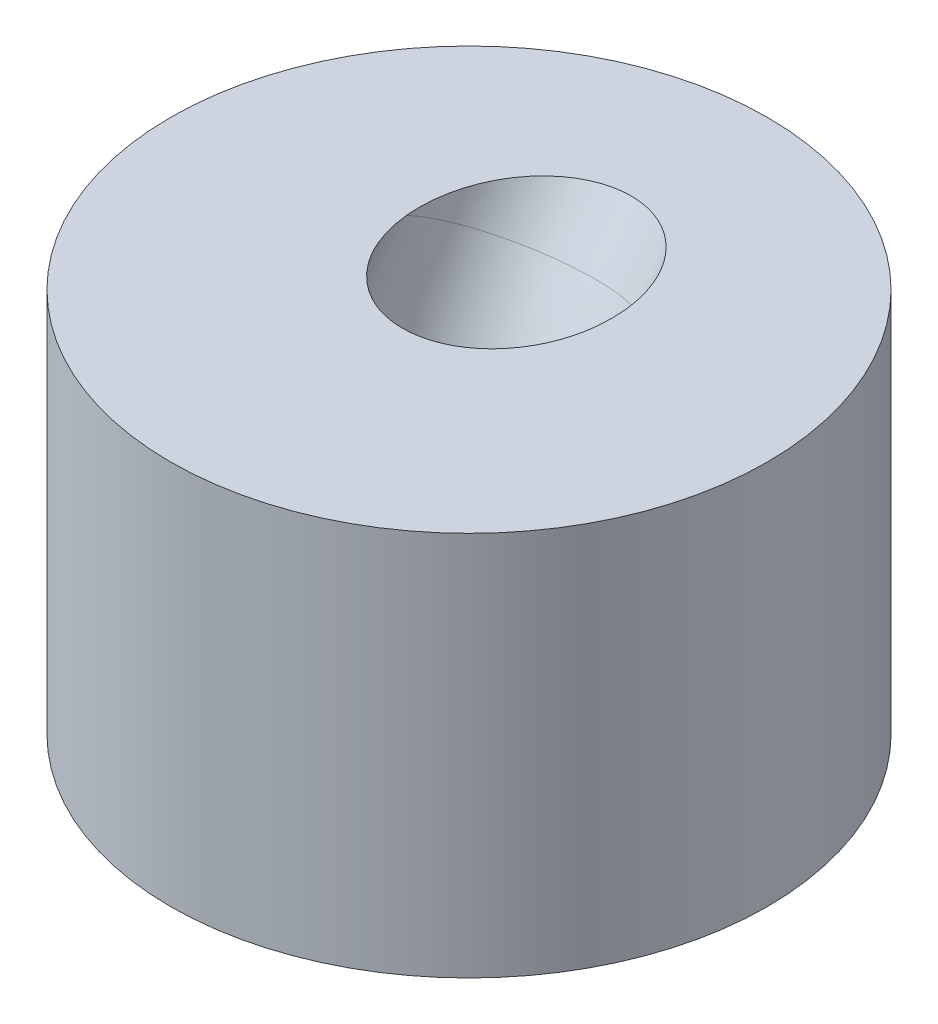
ISO-10303-21;
HEADER;
FILE_DESCRIPTION(('STEP AP214'),'2;1');
FILE_NAME('part.step','',(''),(''),'','','');
FILE_SCHEMA(('AUTOMOTIVE_DESIGN { 1 0 10303 214 1 1 1 1 }'));
ENDSEC;
DATA;
#1=APPLICATION_CONTEXT('core data for automotive mechanical design processes');
#2=APPLICATION_PROTOCOL_DEFINITION('international standard','automotive_design',2000,#1);
#3=PRODUCT_CONTEXT('',#1,'mechanical');
#4=PRODUCT('Part','Part','',(#3));
#5=PRODUCT_RELATED_PRODUCT_CATEGORY('part','',(#4));
#6=PRODUCT_DEFINITION_FORMATION('','',#4);
#7=PRODUCT_DEFINITION_CONTEXT('part definition',#1,'design');
#8=PRODUCT_DEFINITION('design','',#6,#7);
#9=PRODUCT_DEFINITION_SHAPE('','',#8);
#10=(LENGTH_UNIT() NAMED_UNIT(*) SI_UNIT(.MILLI.,.METRE.));
#11=(NAMED_UNIT(*) PLANE_ANGLE_UNIT() SI_UNIT($,.RADIAN.));
#12=(NAMED_UNIT(*) SI_UNIT($,.STERADIAN.) SOLID_ANGLE_UNIT());
#13=UNCERTAINTY_MEASURE_WITH_UNIT(LENGTH_MEASURE(1.E-05),#10,'distance_accuracy_value','');
#14=(GEOMETRIC_REPRESENTATION_CONTEXT(3) GLOBAL_UNCERTAINTY_ASSIGNED_CONTEXT((#13)) GLOBAL_UNIT_ASSIGNED_CONTEXT((#10,
#11,#12)) REPRESENTATION_CONTEXT('',''));
#15=CARTESIAN_POINT('',(0.,0.,0.));
#16=DIRECTION('',(0.,0.,1.));
#17=DIRECTION('',(1.,0.,0.));
#18=AXIS2_PLACEMENT_3D('',#15,#16,#17);
#19=CARTESIAN_POINT('',(0.,1.,0.));
#20=DIRECTION('',(0.,1.,0.));
#21=DIRECTION('',(0.,0.,1.));
#22=AXIS2_PLACEMENT_3D('',#19,#20,#21);
#23=PLANE('',#22);
#24=CARTESIAN_POINT('',(0.,1.,0.));
#25=DIRECTION('',(0.,1.,0.));
#26=DIRECTION('',(0.,0.,1.));
#27=AXIS2_PLACEMENT_3D('',#24,#25,#26);
#28=CIRCLE('',#27,0.775);
#29=CARTESIAN_POINT('',(0.,1.,0.775));
#30=VERTEX_POINT('',#29);
#31=EDGE_CURVE('E48',#30,#30,#28,.T.);
#32=ORIENTED_EDGE('',*,*,#31,.T.);
#33=EDGE_LOOP('',(#32));
#34=FACE_BOUND('',#33,.T.);
#35=CARTESIAN_POINT('',(-0.248215276221464,1.,-0.0855223372953399));
#36=CARTESIAN_POINT('',(-0.246124175049381,1.,-0.0644706667991385));
#37=CARTESIAN_POINT('',(-0.24210697818723,1.,-0.0435278417130061));
#38=CARTESIAN_POINT('',(-0.230138842864011,1.,-0.00270959480504173));
#39=CARTESIAN_POINT('',(-0.222170859785815,1.,0.0171607846832364));
#40=CARTESIAN_POINT('',(-0.204990927327437,1.,0.0495865046512104));
#41=CARTESIAN_POINT('',(-0.196731129213487,1.,0.0626459520367304));
#42=CARTESIAN_POINT('',(-0.178175206384651,1.,0.0872180136886346));
#43=CARTESIAN_POINT('',(-0.167881807736467,1.,0.0987326644500661));
#44=CARTESIAN_POINT('',(-0.145321340496363,1.,0.119826710274702));
#45=CARTESIAN_POINT('',(-0.133040945378598,1.,0.129391976896492));
#46=CARTESIAN_POINT('',(-0.10685532063701,1.,0.145979415976943));
#47=CARTESIAN_POINT('',(-0.0929506049289702,1.,0.153002389919976));
#48=CARTESIAN_POINT('',(-0.0658008355966637,1.,0.163374792792679));
#49=CARTESIAN_POINT('',(-0.0526884157307585,1.,0.167072193668631));
#50=CARTESIAN_POINT('',(-0.0259895384577077,0.999999999999999,0.171979883642039));
#51=CARTESIAN_POINT('',(-0.0124027561369748,0.999999999999998,0.173188432616338));
#52=CARTESIAN_POINT('',(0.0135400435151004,1.,0.17304899610204));
#53=CARTESIAN_POINT('',(0.0258977982896824,1.00000000000001,0.171919322963314));
#54=CARTESIAN_POINT('',(0.050259306033422,0.999999999999993,0.16758858116793));
#55=CARTESIAN_POINT('',(0.0622626030327193,0.999999999999973,0.164384956441295));
#56=CARTESIAN_POINT('',(0.0855144795981385,1.00000000000003,0.156071154860137));
#57=CARTESIAN_POINT('',(0.0967667230127277,1.0000000000001,0.150971175872131));
#58=CARTESIAN_POINT('',(0.118343128334914,0.999999999999901,0.139073446192681));
#59=CARTESIAN_POINT('',(0.128665850129091,0.999999999999629,0.132273120671145));
#60=CARTESIAN_POINT('',(0.159264764842178,1.00000000000079,0.108645536902197));
#61=CARTESIAN_POINT('',(0.177560500223876,1.00000000000451,0.089189901603906));
#62=CARTESIAN_POINT('',(0.209892360590161,0.999999999994933,0.0433999857771069));
#63=CARTESIAN_POINT('',(0.223126429482738,0.999999999979483,0.0165136595637087));
#64=CARTESIAN_POINT('',(0.236505530129137,0.999999999988811,-0.0235475202659346));
#65=CARTESIAN_POINT('',(0.23980852506951,0.999999999995644,-0.0357769723893151));
#66=CARTESIAN_POINT('',(0.245030006059433,1.00000000000434,-0.0604860161791928));
#67=CARTESIAN_POINT('',(0.246953142568255,1.00000000000622,-0.0729646205694481));
#68=CARTESIAN_POINT('',(0.248215276221415,0.999999999999194,-0.0855223372945839));
#69=B_SPLINE_CURVE_WITH_KNOTS('',3,(#35,#36,#37,#38,#39,#40,#41,#42,#43,#44,#45,#46,#47,#48,#49,
#50,#51,#52,#53,#54,#55,#56,#57,#58,#59,#60,#61,#62,#63,#64,#65,#66,#67,#68),.UNSPECIFIED.,.F.,
.F.,(4,2,2,2,2,2,2,2,2,2,2,2,2,2,2,2,4),(0.,0.0635184526410341,0.127313354841293,
0.173479984958425,0.219585142994132,0.266013420517455,0.312427048266889,0.353074863650539,
0.393751089010639,0.430800985192004,0.467896631180527,0.504795610020645,0.541750806916499,
0.620594319427059,0.709147530728517,0.747092037627843,0.784908053813709),.UNSPECIFIED.);
#70=CARTESIAN_POINT('',(-0.248215276221464,1.,-0.0855223372953399));
#71=VERTEX_POINT('',#70);
#72=CARTESIAN_POINT('',(0.248215276221464,1.,-0.0855223372953399));
#73=VERTEX_POINT('',#72);
#74=EDGE_CURVE('E57',#71,#73,#69,.T.);
#75=ORIENTED_EDGE('',*,*,#74,.F.);
#76=CARTESIAN_POINT('',(-0.248215276221464,1.,-0.0855223372953399));
#77=CARTESIAN_POINT('',(-0.25028665344192,1.,-0.106268796895166));
#78=CARTESIAN_POINT('',(-0.250554870402239,1.,-0.127202110870171));
#79=CARTESIAN_POINT('',(-0.247557000832603,0.999999999999999,-0.16753253543577));
#80=CARTESIAN_POINT('',(-0.244504273879469,0.999999999999999,-0.186945817856314));
#81=CARTESIAN_POINT('',(-0.235402870254637,1.00000000000001,-0.224080560944886));
#82=CARTESIAN_POINT('',(-0.229504751758066,1.00000000000002,-0.241838515390821));
#83=CARTESIAN_POINT('',(-0.215297622720401,1.00000000000009,-0.274859683669143));
#84=CARTESIAN_POINT('',(-0.207193760351343,1.00000000000015,-0.290210441057354));
#85=CARTESIAN_POINT('',(-0.189254449640098,1.00000000000025,-0.318074729189423));
#86=CARTESIAN_POINT('',(-0.179622729829535,1.0000000000003,-0.330718361422361));
#87=CARTESIAN_POINT('',(-0.159233846170141,1.00000000000033,-0.353157941768768));
#88=CARTESIAN_POINT('',(-0.148644525607957,1.00000000000032,-0.363105234541551));
#89=CARTESIAN_POINT('',(-0.126802123487262,1.00000000000025,-0.38032762052075));
#90=CARTESIAN_POINT('',(-0.115667298648004,1.00000000000021,-0.387751609865257));
#91=CARTESIAN_POINT('',(-0.0930464816948879,1.00000000000012,-0.400167071172064));
#92=CARTESIAN_POINT('',(-0.0816306849954921,1.00000000000009,-0.40528555493495));
#93=CARTESIAN_POINT('',(-0.0586385820530041,1.00000000000004,-0.413316171500651));
#94=CARTESIAN_POINT('',(-0.0470944934858634,1.00000000000002,-0.416319931464706));
#95=CARTESIAN_POINT('',(-0.0239502602514634,1.00000000000001,-0.420290485545516));
#96=CARTESIAN_POINT('',(-0.0123584295587039,1.,-0.42130541653493));
#97=CARTESIAN_POINT('',(0.0108270354387798,1.,-0.421390594164474));
#98=CARTESIAN_POINT('',(0.0224206667030261,1.,-0.420461696707975));
#99=CARTESIAN_POINT('',(0.0454385790931325,1.,-0.41668488324374));
#100=CARTESIAN_POINT('',(0.0568589542307153,0.999999999999999,-0.41381321721285));
#101=CARTESIAN_POINT('',(0.0790986976212688,1.,-0.406275347574439));
#102=CARTESIAN_POINT('',(0.0899171144777534,1.,-0.40160639066646));
#103=CARTESIAN_POINT('',(0.121999597683588,1.00000000000001,-0.384725616676555));
#104=CARTESIAN_POINT('',(0.141884405543346,0.999999999999998,-0.36982166281364));
#105=CARTESIAN_POINT('',(0.179000598662868,1.00000000000002,-0.333011978850793));
#106=CARTESIAN_POINT('',(0.195565607843253,1.00000000000006,-0.31045381915996));
#107=CARTESIAN_POINT('',(0.21654497553342,1.00000000000004,-0.272189472804572));
#108=CARTESIAN_POINT('',(0.223137911489291,1.00000000000001,-0.257602544000118));
#109=CARTESIAN_POINT('',(0.234173862313291,0.99999999999999,-0.227633152818644));
#110=CARTESIAN_POINT('',(0.238617587640675,0.999999999999997,-0.21225095519541));
#111=CARTESIAN_POINT('',(0.245365532066509,1.,-0.181036954373498));
#112=CARTESIAN_POINT('',(0.247670167297284,1.,-0.165205239240495));
#113=CARTESIAN_POINT('',(0.250563935535714,0.999999999999998,-0.128076250792981));
#114=CARTESIAN_POINT('',(0.25032810727948,0.999999999999995,-0.106711608143289));
#115=CARTESIAN_POINT('',(0.248215276221464,1.,-0.0855223372953402));
#116=B_SPLINE_CURVE_WITH_KNOTS('',3,(#76,#77,#78,#79,#80,#81,#82,#83,#84,#85,#86,#87,#88,#89,
#90,#91,#92,#93,#94,#95,#96,#97,#98,#99,#100,#101,#102,#103,#104,#105,#106,#107,#108,#109,#110,
#111,#112,#113,#114,#115),.UNSPECIFIED.,.F.,.F.,(4,2,2,2,2,2,2,2,2,2,2,2,2,2,2,2,2,2,2,4),(0.,
0.0624806338945161,0.121171983539215,0.177051161265889,0.228890111769629,0.276356264416739,
0.319743418434738,0.359707972136692,0.397067618916713,0.432687898133009,0.467434835550426,
0.502166476472362,0.537330567059254,0.572548741876997,0.645916590712587,0.728684477337392,
0.776568210002096,0.82443610302227,0.872294682009731,0.936062774952509),.UNSPECIFIED.);
#117=EDGE_CURVE('E11',#71,#73,#116,.T.);
#118=ORIENTED_EDGE('',*,*,#117,.T.);
#119=EDGE_LOOP('',(#75,#118));
#120=FACE_BOUND('',#119,.T.);
#121=ADVANCED_FACE('F35',(#34,#120),#23,.T.);
#122=CARTESIAN_POINT('',(0.,1.,0.));
#123=DIRECTION('',(0.,-1.,0.));
#124=DIRECTION('',(0.,0.,-1.));
#125=AXIS2_PLACEMENT_3D('',#122,#123,#124);
#126=CYLINDRICAL_SURFACE('',#125,0.775);
#127=ORIENTED_EDGE('',*,*,#31,.F.);
#128=EDGE_LOOP('',(#127));
#129=FACE_BOUND('',#128,.T.);
#130=CARTESIAN_POINT('',(0.,0.,0.));
#131=DIRECTION('',(0.,1.,0.));
#132=DIRECTION('',(0.,0.,1.));
#133=AXIS2_PLACEMENT_3D('',#130,#131,#132);
#134=CIRCLE('',#133,0.775);
#135=CARTESIAN_POINT('',(0.,0.,0.775));
#136=VERTEX_POINT('',#135);
#137=EDGE_CURVE('E61',#136,#136,#134,.T.);
#138=ORIENTED_EDGE('',*,*,#137,.T.);
#139=EDGE_LOOP('',(#138));
#140=FACE_BOUND('',#139,.T.);
#141=ADVANCED_FACE('F37',(#129,#140),#126,.T.);
#142=CARTESIAN_POINT('',(0.,0.,0.));
#143=DIRECTION('',(0.,1.,0.));
#144=DIRECTION('',(0.,0.,1.));
#145=AXIS2_PLACEMENT_3D('',#142,#143,#144);
#146=PLANE('',#145);
#147=CARTESIAN_POINT('',(0.,0.,0.222094232736226));
#148=DIRECTION('',(0.,-1.,0.));
#149=DIRECTION('',(0.,0.,-1.));
#150=AXIS2_PLACEMENT_3D('',#147,#148,#149);
#151=CIRCLE('',#150,0.25);
#152=CARTESIAN_POINT('',(0.,0.,-0.0279057672637744));
#153=VERTEX_POINT('',#152);
#154=EDGE_CURVE('E65',#153,#153,#151,.T.);
#155=ORIENTED_EDGE('',*,*,#154,.F.);
#156=EDGE_LOOP('',(#155));
#157=FACE_BOUND('',#156,.T.);
#158=ORIENTED_EDGE('',*,*,#137,.F.);
#159=EDGE_LOOP('',(#158));
#160=FACE_BOUND('',#159,.T.);
#161=ADVANCED_FACE('F72',(#157,#160),#146,.F.);
#162=CARTESIAN_POINT('',(0.,0.985056323465509,-0.111326662164142));
#163=DIRECTION('',(0.,-0.865363306417067,0.501145036797653));
#164=DIRECTION('',(0.,-0.501145036797653,-0.865363306417067));
#165=AXIS2_PLACEMENT_3D('',#162,#163,#164);
#166=CIRCLE('',#165,0.25);
#167=DIRECTION('',(0.,0.831515417757781,-0.55550167419289));
#168=VECTOR('',#167,1.);
#169=SURFACE_OF_LINEAR_EXTRUSION('',#166,#168);
#170=EDGE_CURVE('E54',#71,#73,#166,.T.);
#171=ORIENTED_EDGE('',*,*,#170,.T.);
#172=ORIENTED_EDGE('',*,*,#117,.F.);
#173=EDGE_LOOP('',(#171,#172));
#174=FACE_BOUND('',#173,.T.);
#175=ADVANCED_FACE('F64',(#174),#169,.T.);
#176=CARTESIAN_POINT('',(0.,-0.128001881739482,-1.77790576726377));
#177=DIRECTION('',(1.,0.,0.));
#178=AXIS1_PLACEMENT('',#176,#177);
#179=SURFACE_OF_REVOLUTION('',#166,#178);
#180=ORIENTED_EDGE('',*,*,#74,.T.);
#181=ORIENTED_EDGE('',*,*,#170,.F.);
#182=EDGE_LOOP('',(#180,#181));
#183=FACE_BOUND('',#182,.T.);
#184=ORIENTED_EDGE('',*,*,#154,.T.);
#185=EDGE_LOOP('',(#184));
#186=FACE_BOUND('',#185,.T.);
#187=ADVANCED_FACE('F58',(#183,#186),#179,.T.);
#188=CLOSED_SHELL('',(#121,#141,#161,#175,#187));
#189=MANIFOLD_SOLID_BREP('B2',#188);
#190=ADVANCED_BREP_SHAPE_REPRESENTATION('',(#18,#189),#14);
#191=SHAPE_DEFINITION_REPRESENTATION(#9,#190);
ENDSEC;
END-ISO-10303-21;
